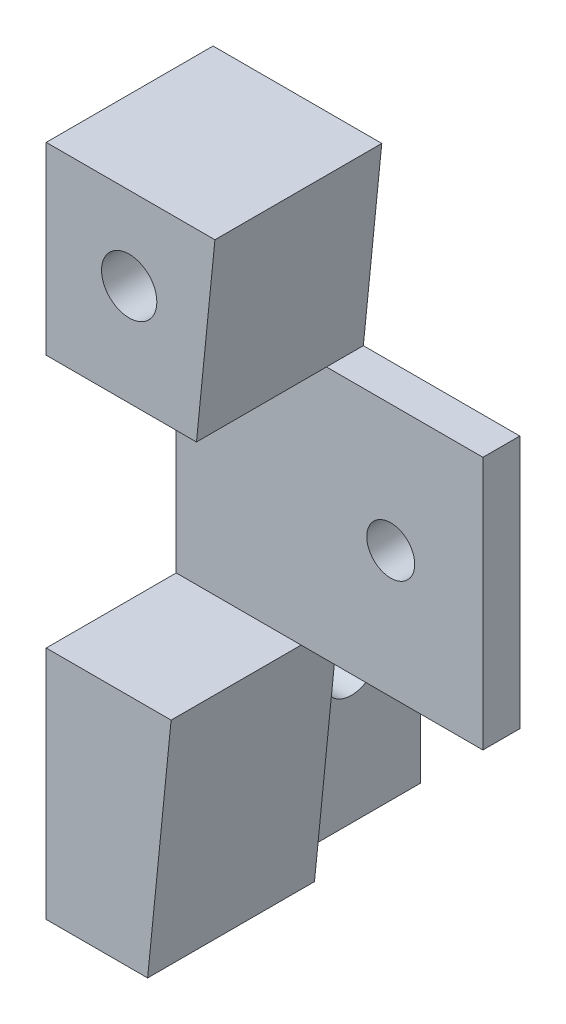
ISO-10303-21;
HEADER;
FILE_DESCRIPTION(('STEP AP214'),'2;1');
FILE_NAME('part.step','',(''),(''),'','','');
FILE_SCHEMA(('AUTOMOTIVE_DESIGN { 1 0 10303 214 1 1 1 1 }'));
ENDSEC;
DATA;
#1=APPLICATION_CONTEXT('core data for automotive mechanical design processes');
#2=APPLICATION_PROTOCOL_DEFINITION('international standard','automotive_design',2000,#1);
#3=PRODUCT_CONTEXT('',#1,'mechanical');
#4=PRODUCT('Part','Part','',(#3));
#5=PRODUCT_RELATED_PRODUCT_CATEGORY('part','',(#4));
#6=PRODUCT_DEFINITION_FORMATION('','',#4);
#7=PRODUCT_DEFINITION_CONTEXT('part definition',#1,'design');
#8=PRODUCT_DEFINITION('design','',#6,#7);
#9=PRODUCT_DEFINITION_SHAPE('','',#8);
#10=(LENGTH_UNIT() NAMED_UNIT(*) SI_UNIT(.MILLI.,.METRE.));
#11=(NAMED_UNIT(*) PLANE_ANGLE_UNIT() SI_UNIT($,.RADIAN.));
#12=(NAMED_UNIT(*) SI_UNIT($,.STERADIAN.) SOLID_ANGLE_UNIT());
#13=UNCERTAINTY_MEASURE_WITH_UNIT(LENGTH_MEASURE(1.E-05),#10,'distance_accuracy_value','');
#14=(GEOMETRIC_REPRESENTATION_CONTEXT(3) GLOBAL_UNCERTAINTY_ASSIGNED_CONTEXT((#13)) GLOBAL_UNIT_ASSIGNED_CONTEXT((#10,
#11,#12)) REPRESENTATION_CONTEXT('',''));
#15=CARTESIAN_POINT('',(0.,0.,0.));
#16=DIRECTION('',(0.,0.,1.));
#17=DIRECTION('',(1.,0.,0.));
#18=AXIS2_PLACEMENT_3D('',#15,#16,#17);
#19=CARTESIAN_POINT('',(0.,0.,22.1000000000013));
#20=DIRECTION('',(0.,0.,-1.));
#21=DIRECTION('',(1.,0.,0.));
#22=AXIS2_PLACEMENT_3D('',#19,#20,#21);
#23=PLANE('',#22);
#24=CARTESIAN_POINT('',(137.270000000002,-335.749999999999,22.1000000000013));
#25=DIRECTION('',(0.,0.,1.));
#26=DIRECTION('',(1.,0.,0.));
#27=AXIS2_PLACEMENT_3D('',#24,#25,#26);
#28=CIRCLE('',#27,2.59999999999999);
#29=CARTESIAN_POINT('',(139.870000000002,-335.749999999999,22.1000000000013));
#30=VERTEX_POINT('',#29);
#31=EDGE_CURVE('E180',#30,#30,#28,.T.);
#32=ORIENTED_EDGE('',*,*,#31,.F.);
#33=EDGE_LOOP('',(#32));
#34=FACE_BOUND('',#33,.T.);
#35=DIRECTION('',(1.,0.,0.));
#36=VECTOR('',#35,1.);
#37=CARTESIAN_POINT('',(130.3,-321.999999999999,22.1000000000013));
#38=LINE('',#37,#36);
#39=CARTESIAN_POINT('',(114.000000000002,-321.999999999999,22.1000000000013));
#40=VERTEX_POINT('',#39);
#41=CARTESIAN_POINT('',(130.3,-321.999999999999,22.1000000000013));
#42=VERTEX_POINT('',#41);
#43=EDGE_CURVE('E197',#40,#42,#38,.T.);
#44=ORIENTED_EDGE('',*,*,#43,.F.);
#45=DIRECTION('',(0.,1.,0.));
#46=VECTOR('',#45,1.);
#47=CARTESIAN_POINT('',(114.000000000002,0.,22.1000000000013));
#48=LINE('',#47,#46);
#49=CARTESIAN_POINT('',(114.000000000002,-349.499999999999,22.1000000000013));
#50=VERTEX_POINT('',#49);
#51=EDGE_CURVE('E233',#50,#40,#48,.T.);
#52=ORIENTED_EDGE('',*,*,#51,.F.);
#53=DIRECTION('',(-1.,0.,0.));
#54=VECTOR('',#53,1.);
#55=CARTESIAN_POINT('',(127.55,-349.499999999999,22.1000000000013));
#56=LINE('',#55,#54);
#57=CARTESIAN_POINT('',(127.55,-349.499999999999,22.1000000000013));
#58=VERTEX_POINT('',#57);
#59=EDGE_CURVE('E250',#58,#50,#56,.T.);
#60=ORIENTED_EDGE('',*,*,#59,.F.);
#61=DIRECTION('',(-1.,0.,0.));
#62=VECTOR('',#61,1.);
#63=CARTESIAN_POINT('',(-2.63602545588444E-11,-349.499999999989,22.1000000000013));
#64=LINE('',#63,#62);
#65=CARTESIAN_POINT('',(147.270000000011,-349.5,22.1000000000013));
#66=VERTEX_POINT('',#65);
#67=EDGE_CURVE('E217',#66,#58,#64,.T.);
#68=ORIENTED_EDGE('',*,*,#67,.F.);
#69=DIRECTION('',(0.,1.,0.));
#70=VECTOR('',#69,1.);
#71=CARTESIAN_POINT('',(147.270000000011,-322.,22.1000000000013));
#72=LINE('',#71,#70);
#73=CARTESIAN_POINT('',(147.270000000011,-322.,22.1000000000013));
#74=VERTEX_POINT('',#73);
#75=EDGE_CURVE('E187',#66,#74,#72,.T.);
#76=ORIENTED_EDGE('',*,*,#75,.T.);
#77=DIRECTION('',(1.,0.,0.));
#78=VECTOR('',#77,1.);
#79=CARTESIAN_POINT('',(-2.98656486156187E-11,-321.999999999986,22.1000000000013));
#80=LINE('',#79,#78);
#81=EDGE_CURVE('E208',#42,#74,#80,.T.);
#82=ORIENTED_EDGE('',*,*,#81,.F.);
#83=EDGE_LOOP('',(#44,#52,#60,#68,#76,#82));
#84=FACE_BOUND('',#83,.T.);
#85=ADVANCED_FACE('F49',(#34,#84),#23,.F.);
#86=CARTESIAN_POINT('',(114.000000000002,-374.999999999999,-6.77650428981949));
#87=DIRECTION('',(1.36254643931287E-13,1.,0.));
#88=DIRECTION('',(-1.,1.36254643931287E-13,0.));
#89=AXIS2_PLACEMENT_3D('',#86,#87,#88);
#90=PLANE('',#89);
#91=DIRECTION('',(0.,0.,1.));
#92=VECTOR('',#91,1.);
#93=CARTESIAN_POINT('',(125.,-375.,-6.77650428981949));
#94=LINE('',#93,#92);
#95=CARTESIAN_POINT('',(125.,-375.,18.1000000000013));
#96=VERTEX_POINT('',#95);
#97=CARTESIAN_POINT('',(125.,-375.,36.2000000000025));
#98=VERTEX_POINT('',#97);
#99=EDGE_CURVE('E259',#96,#98,#94,.T.);
#100=ORIENTED_EDGE('',*,*,#99,.T.);
#101=DIRECTION('',(1.,-1.36254643931287E-13,0.));
#102=VECTOR('',#101,1.);
#103=CARTESIAN_POINT('',(114.000000000002,-374.999999999999,36.2000000000025));
#104=LINE('',#103,#102);
#105=CARTESIAN_POINT('',(114.000000000002,-374.999999999999,36.2000000000025));
#106=VERTEX_POINT('',#105);
#107=EDGE_CURVE('E260',#106,#98,#104,.T.);
#108=ORIENTED_EDGE('',*,*,#107,.F.);
#109=DIRECTION('',(0.,0.,1.));
#110=VECTOR('',#109,1.);
#111=CARTESIAN_POINT('',(114.000000000002,-374.999999999999,-6.77650428981949));
#112=LINE('',#111,#110);
#113=CARTESIAN_POINT('',(114.000000000002,-374.999999999999,3.10000000000127));
#114=VERTEX_POINT('',#113);
#115=EDGE_CURVE('E168',#114,#106,#112,.T.);
#116=ORIENTED_EDGE('',*,*,#115,.F.);
#117=DIRECTION('',(-1.,0.,0.));
#118=VECTOR('',#117,1.);
#119=CARTESIAN_POINT('',(114.000000000002,-374.999999999999,3.10000000000127));
#120=LINE('',#119,#118);
#121=CARTESIAN_POINT('',(121.500000000002,-374.999999999999,3.10000000000127));
#122=VERTEX_POINT('',#121);
#123=EDGE_CURVE('E151',#122,#114,#120,.T.);
#124=ORIENTED_EDGE('',*,*,#123,.F.);
#125=DIRECTION('',(0.,0.,1.));
#126=VECTOR('',#125,1.);
#127=CARTESIAN_POINT('',(121.500000000002,-374.999999999999,3.10000000000127));
#128=LINE('',#127,#126);
#129=CARTESIAN_POINT('',(121.500000000002,-374.999999999999,18.1000000000013));
#130=VERTEX_POINT('',#129);
#131=EDGE_CURVE('E158',#122,#130,#128,.T.);
#132=ORIENTED_EDGE('',*,*,#131,.T.);
#133=DIRECTION('',(1.,-1.36254643931287E-13,0.));
#134=VECTOR('',#133,1.);
#135=CARTESIAN_POINT('',(-5.10954914742303E-11,-374.999999999983,18.1000000000013));
#136=LINE('',#135,#134);
#137=EDGE_CURVE('E223',#130,#96,#136,.T.);
#138=ORIENTED_EDGE('',*,*,#137,.T.);
#139=EDGE_LOOP('',(#100,#108,#116,#124,#132,#138));
#140=FACE_BOUND('',#139,.T.);
#141=ADVANCED_FACE('F165',(#140),#90,.F.);
#142=CARTESIAN_POINT('',(125.,-375.,-6.77650428981949));
#143=DIRECTION('',(-0.995037190209989,0.0995037190209987,0.));
#144=DIRECTION('',(-0.0995037190209987,-0.995037190209989,0.));
#145=AXIS2_PLACEMENT_3D('',#142,#143,#144);
#146=PLANE('',#145);
#147=DIRECTION('',(0.,0.,1.));
#148=VECTOR('',#147,1.);
#149=CARTESIAN_POINT('',(127.55,-349.499999999999,-6.77650428981949));
#150=LINE('',#149,#148);
#151=CARTESIAN_POINT('',(127.55,-349.499999999999,36.2000000000025));
#152=VERTEX_POINT('',#151);
#153=EDGE_CURVE('E255',#58,#152,#150,.T.);
#154=ORIENTED_EDGE('',*,*,#153,.T.);
#155=DIRECTION('',(0.0995037190209987,0.995037190209989,0.));
#156=VECTOR('',#155,1.);
#157=CARTESIAN_POINT('',(125.,-375.,36.2000000000025));
#158=LINE('',#157,#156);
#159=EDGE_CURVE('E256',#98,#152,#158,.T.);
#160=ORIENTED_EDGE('',*,*,#159,.F.);
#161=ORIENTED_EDGE('',*,*,#99,.F.);
#162=DIRECTION('',(0.0995037190209987,0.995037190209989,0.));
#163=VECTOR('',#162,1.);
#164=CARTESIAN_POINT('',(160.891089108911,-16.0891089108911,18.1000000000013));
#165=LINE('',#164,#163);
#166=CARTESIAN_POINT('',(127.55,-349.499999999999,18.1000000000013));
#167=VERTEX_POINT('',#166);
#168=EDGE_CURVE('E225',#96,#167,#165,.T.);
#169=ORIENTED_EDGE('',*,*,#168,.T.);
#170=DIRECTION('',(0.,0.,1.));
#171=VECTOR('',#170,1.);
#172=CARTESIAN_POINT('',(127.55,-349.499999999999,18.1000000000013));
#173=LINE('',#172,#171);
#174=EDGE_CURVE('E230',#167,#58,#173,.T.);
#175=ORIENTED_EDGE('',*,*,#174,.T.);
#176=EDGE_LOOP('',(#154,#160,#161,#169,#175));
#177=FACE_BOUND('',#176,.T.);
#178=ADVANCED_FACE('F313',(#177),#146,.F.);
#179=CARTESIAN_POINT('',(127.55,-349.499999999999,-6.77650428981949));
#180=DIRECTION('',(0.,-1.,0.));
#181=DIRECTION('',(0.,0.,1.));
#182=AXIS2_PLACEMENT_3D('',#179,#180,#181);
#183=PLANE('',#182);
#184=ORIENTED_EDGE('',*,*,#59,.T.);
#185=DIRECTION('',(0.,0.,1.));
#186=VECTOR('',#185,1.);
#187=CARTESIAN_POINT('',(114.000000000002,-349.499999999999,-6.77650428981949));
#188=LINE('',#187,#186);
#189=CARTESIAN_POINT('',(114.000000000002,-349.499999999999,36.2000000000025));
#190=VERTEX_POINT('',#189);
#191=EDGE_CURVE('E251',#50,#190,#188,.T.);
#192=ORIENTED_EDGE('',*,*,#191,.T.);
#193=DIRECTION('',(-1.,0.,0.));
#194=VECTOR('',#193,1.);
#195=CARTESIAN_POINT('',(127.55,-349.499999999999,36.2000000000025));
#196=LINE('',#195,#194);
#197=EDGE_CURVE('E252',#152,#190,#196,.T.);
#198=ORIENTED_EDGE('',*,*,#197,.F.);
#199=ORIENTED_EDGE('',*,*,#153,.F.);
#200=EDGE_LOOP('',(#184,#192,#198,#199));
#201=FACE_BOUND('',#200,.T.);
#202=ADVANCED_FACE('F361',(#201),#183,.F.);
#203=CARTESIAN_POINT('',(114.000000000002,-349.499999999999,-6.77650428981949));
#204=DIRECTION('',(1.,0.,0.));
#205=DIRECTION('',(0.,0.,1.));
#206=AXIS2_PLACEMENT_3D('',#203,#204,#205);
#207=PLANE('',#206);
#208=CARTESIAN_POINT('',(114.000000000002,-359.999999999999,10.6000000000013));
#209=DIRECTION('',(1.,0.,0.));
#210=DIRECTION('',(0.,0.,-1.));
#211=AXIS2_PLACEMENT_3D('',#208,#209,#210);
#212=CIRCLE('',#211,3.);
#213=CARTESIAN_POINT('',(114.000000000002,-359.999999999999,7.60000000000127));
#214=VERTEX_POINT('',#213);
#215=EDGE_CURVE('E172',#214,#214,#212,.T.);
#216=ORIENTED_EDGE('',*,*,#215,.T.);
#217=EDGE_LOOP('',(#216));
#218=FACE_BOUND('',#217,.T.);
#219=ORIENTED_EDGE('',*,*,#115,.T.);
#220=DIRECTION('',(0.,-1.,0.));
#221=VECTOR('',#220,1.);
#222=CARTESIAN_POINT('',(114.000000000002,-349.499999999999,36.2000000000025));
#223=LINE('',#222,#221);
#224=EDGE_CURVE('E248',#190,#106,#223,.T.);
#225=ORIENTED_EDGE('',*,*,#224,.F.);
#226=ORIENTED_EDGE('',*,*,#191,.F.);
#227=ORIENTED_EDGE('',*,*,#51,.T.);
#228=DIRECTION('',(0.,0.,1.));
#229=VECTOR('',#228,1.);
#230=CARTESIAN_POINT('',(114.000000000002,-321.999999999999,-6.77650428981949));
#231=LINE('',#230,#229);
#232=CARTESIAN_POINT('',(114.000000000002,-321.999999999999,36.2000000000025));
#233=VERTEX_POINT('',#232);
#234=EDGE_CURVE('E201',#40,#233,#231,.T.);
#235=ORIENTED_EDGE('',*,*,#234,.T.);
#236=DIRECTION('',(0.,-1.,0.));
#237=VECTOR('',#236,1.);
#238=CARTESIAN_POINT('',(114.000000000002,-321.999999999999,36.2000000000025));
#239=LINE('',#238,#237);
#240=CARTESIAN_POINT('',(114.000000000002,-301.999999999999,36.2000000000025));
#241=VERTEX_POINT('',#240);
#242=EDGE_CURVE('E202',#241,#233,#239,.T.);
#243=ORIENTED_EDGE('',*,*,#242,.F.);
#244=DIRECTION('',(0.,0.,1.));
#245=VECTOR('',#244,1.);
#246=CARTESIAN_POINT('',(114.000000000002,-301.999999999999,18.1000000000013));
#247=LINE('',#246,#245);
#248=CARTESIAN_POINT('',(114.000000000002,-301.999999999999,18.1000000000013));
#249=VERTEX_POINT('',#248);
#250=EDGE_CURVE('E239',#249,#241,#247,.T.);
#251=ORIENTED_EDGE('',*,*,#250,.F.);
#252=DIRECTION('',(0.,1.,0.));
#253=VECTOR('',#252,1.);
#254=CARTESIAN_POINT('',(114.000000000002,0.,18.1000000000013));
#255=LINE('',#254,#253);
#256=CARTESIAN_POINT('',(114.000000000002,-339.499999999998,18.1000000000013));
#257=VERTEX_POINT('',#256);
#258=EDGE_CURVE('E221',#257,#249,#255,.T.);
#259=ORIENTED_EDGE('',*,*,#258,.F.);
#260=DIRECTION('',(0.,-0.499999999999996,-0.866025403784441));
#261=VECTOR('',#260,1.);
#262=CARTESIAN_POINT('',(114.000000000002,-352.771842336167,-4.88750523628661));
#263=LINE('',#262,#261);
#264=CARTESIAN_POINT('',(114.000000000002,-348.160254037843,3.10000000000127));
#265=VERTEX_POINT('',#264);
#266=EDGE_CURVE('E11',#257,#265,#263,.T.);
#267=ORIENTED_EDGE('',*,*,#266,.T.);
#268=DIRECTION('',(0.,1.,0.));
#269=VECTOR('',#268,1.);
#270=CARTESIAN_POINT('',(114.000000000002,-374.999999999999,3.10000000000127));
#271=LINE('',#270,#269);
#272=EDGE_CURVE('E65',#114,#265,#271,.T.);
#273=ORIENTED_EDGE('',*,*,#272,.F.);
#274=EDGE_LOOP('',(#219,#225,#226,#227,#235,#243,#251,#259,#267,#273));
#275=FACE_BOUND('',#274,.T.);
#276=ADVANCED_FACE('F285',(#218,#275),#207,.F.);
#277=CARTESIAN_POINT('',(0.,0.,36.2000000000025));
#278=DIRECTION('',(0.,0.,1.));
#279=DIRECTION('',(-1.,0.,0.));
#280=AXIS2_PLACEMENT_3D('',#277,#278,#279);
#281=PLANE('',#280);
#282=ORIENTED_EDGE('',*,*,#107,.T.);
#283=ORIENTED_EDGE('',*,*,#159,.T.);
#284=ORIENTED_EDGE('',*,*,#197,.T.);
#285=ORIENTED_EDGE('',*,*,#224,.T.);
#286=EDGE_LOOP('',(#282,#283,#284,#285));
#287=FACE_BOUND('',#286,.T.);
#288=ADVANCED_FACE('F315',(#287),#281,.T.);
#289=CARTESIAN_POINT('',(-2.98656486156187E-11,-321.999999999986,18.1000000000013));
#290=DIRECTION('',(0.,1.,0.));
#291=DIRECTION('',(-1.,0.,0.));
#292=AXIS2_PLACEMENT_3D('',#289,#290,#291);
#293=PLANE('',#292);
#294=ORIENTED_EDGE('',*,*,#81,.T.);
#295=DIRECTION('',(0.,0.,-1.));
#296=VECTOR('',#295,1.);
#297=CARTESIAN_POINT('',(147.270000000011,-322.,18.1000000000013));
#298=LINE('',#297,#296);
#299=CARTESIAN_POINT('',(147.270000000011,-322.,18.1000000000013));
#300=VERTEX_POINT('',#299);
#301=EDGE_CURVE('E190',#74,#300,#298,.T.);
#302=ORIENTED_EDGE('',*,*,#301,.T.);
#303=DIRECTION('',(1.,0.,0.));
#304=VECTOR('',#303,1.);
#305=CARTESIAN_POINT('',(-2.98656486156187E-11,-321.999999999986,18.1000000000013));
#306=LINE('',#305,#304);
#307=CARTESIAN_POINT('',(130.3,-321.999999999999,18.1000000000013));
#308=VERTEX_POINT('',#307);
#309=EDGE_CURVE('E213',#308,#300,#306,.T.);
#310=ORIENTED_EDGE('',*,*,#309,.F.);
#311=DIRECTION('',(0.,0.,1.));
#312=VECTOR('',#311,1.);
#313=CARTESIAN_POINT('',(130.3,-321.999999999999,18.1000000000013));
#314=LINE('',#313,#312);
#315=EDGE_CURVE('E245',#308,#42,#314,.T.);
#316=ORIENTED_EDGE('',*,*,#315,.T.);
#317=EDGE_LOOP('',(#294,#302,#310,#316));
#318=FACE_BOUND('',#317,.T.);
#319=ADVANCED_FACE('F298',(#318),#293,.T.);
#320=CARTESIAN_POINT('',(160.891089108911,-16.0891089108911,18.1000000000013));
#321=DIRECTION('',(0.995037190209989,-0.0995037190209989,0.));
#322=DIRECTION('',(0.0995037190209989,0.995037190209989,0.));
#323=AXIS2_PLACEMENT_3D('',#320,#321,#322);
#324=PLANE('',#323);
#325=ORIENTED_EDGE('',*,*,#315,.F.);
#326=DIRECTION('',(-0.0995037190209988,-0.995037190209989,0.));
#327=VECTOR('',#326,1.);
#328=CARTESIAN_POINT('',(160.891089108911,-16.0891089108911,18.1000000000013));
#329=LINE('',#328,#327);
#330=CARTESIAN_POINT('',(132.3,-301.999999999999,18.1000000000013));
#331=VERTEX_POINT('',#330);
#332=EDGE_CURVE('E216',#331,#308,#329,.T.);
#333=ORIENTED_EDGE('',*,*,#332,.F.);
#334=DIRECTION('',(0.,0.,1.));
#335=VECTOR('',#334,1.);
#336=CARTESIAN_POINT('',(132.3,-301.999999999999,18.1000000000013));
#337=LINE('',#336,#335);
#338=CARTESIAN_POINT('',(132.3,-301.999999999999,36.2000000000025));
#339=VERTEX_POINT('',#338);
#340=EDGE_CURVE('E242',#331,#339,#337,.T.);
#341=ORIENTED_EDGE('',*,*,#340,.T.);
#342=DIRECTION('',(0.0995037190209989,0.995037190209989,0.));
#343=VECTOR('',#342,1.);
#344=CARTESIAN_POINT('',(132.3,-301.999999999999,36.2000000000025));
#345=LINE('',#344,#343);
#346=CARTESIAN_POINT('',(130.3,-321.999999999999,36.2000000000025));
#347=VERTEX_POINT('',#346);
#348=EDGE_CURVE('E194',#347,#339,#345,.T.);
#349=ORIENTED_EDGE('',*,*,#348,.F.);
#350=DIRECTION('',(0.,0.,1.));
#351=VECTOR('',#350,1.);
#352=CARTESIAN_POINT('',(130.3,-321.999999999999,-6.77650428981949));
#353=LINE('',#352,#351);
#354=EDGE_CURVE('E198',#42,#347,#353,.T.);
#355=ORIENTED_EDGE('',*,*,#354,.F.);
#356=EDGE_LOOP('',(#325,#333,#341,#349,#355));
#357=FACE_BOUND('',#356,.T.);
#358=ADVANCED_FACE('F294',(#357),#324,.T.);
#359=CARTESIAN_POINT('',(0.,-301.999999999999,18.1000000000013));
#360=DIRECTION('',(0.,1.,0.));
#361=DIRECTION('',(0.,0.,-1.));
#362=AXIS2_PLACEMENT_3D('',#359,#360,#361);
#363=PLANE('',#362);
#364=ORIENTED_EDGE('',*,*,#340,.F.);
#365=DIRECTION('',(1.,0.,0.));
#366=VECTOR('',#365,1.);
#367=CARTESIAN_POINT('',(0.,-301.999999999999,18.1000000000013));
#368=LINE('',#367,#366);
#369=EDGE_CURVE('E219',#249,#331,#368,.T.);
#370=ORIENTED_EDGE('',*,*,#369,.F.);
#371=ORIENTED_EDGE('',*,*,#250,.T.);
#372=DIRECTION('',(-1.,0.,0.));
#373=VECTOR('',#372,1.);
#374=CARTESIAN_POINT('',(114.000000000002,-301.999999999999,36.2000000000025));
#375=LINE('',#374,#373);
#376=EDGE_CURVE('E193',#339,#241,#375,.T.);
#377=ORIENTED_EDGE('',*,*,#376,.F.);
#378=EDGE_LOOP('',(#364,#370,#371,#377));
#379=FACE_BOUND('',#378,.T.);
#380=ADVANCED_FACE('F289',(#379),#363,.T.);
#381=CARTESIAN_POINT('',(-2.63602545588444E-11,-349.499999999989,18.1000000000013));
#382=DIRECTION('',(0.,-1.,0.));
#383=DIRECTION('',(1.,0.,0.));
#384=AXIS2_PLACEMENT_3D('',#381,#382,#383);
#385=PLANE('',#384);
#386=ORIENTED_EDGE('',*,*,#67,.T.);
#387=ORIENTED_EDGE('',*,*,#174,.F.);
#388=DIRECTION('',(-1.,0.,0.));
#389=VECTOR('',#388,1.);
#390=CARTESIAN_POINT('',(-2.63602545588444E-11,-349.499999999989,18.1000000000013));
#391=LINE('',#390,#389);
#392=CARTESIAN_POINT('',(147.270000000011,-349.5,18.1000000000013));
#393=VERTEX_POINT('',#392);
#394=EDGE_CURVE('E228',#393,#167,#391,.T.);
#395=ORIENTED_EDGE('',*,*,#394,.F.);
#396=DIRECTION('',(0.,0.,1.));
#397=VECTOR('',#396,1.);
#398=CARTESIAN_POINT('',(147.270000000011,-349.5,18.1000000000013));
#399=LINE('',#398,#397);
#400=EDGE_CURVE('E185',#393,#66,#399,.T.);
#401=ORIENTED_EDGE('',*,*,#400,.T.);
#402=EDGE_LOOP('',(#386,#387,#395,#401));
#403=FACE_BOUND('',#402,.T.);
#404=ADVANCED_FACE('F309',(#403),#385,.T.);
#405=CARTESIAN_POINT('',(0.,0.,18.1000000000013));
#406=DIRECTION('',(0.,0.,-1.));
#407=DIRECTION('',(1.,0.,0.));
#408=AXIS2_PLACEMENT_3D('',#405,#406,#407);
#409=PLANE('',#408);
#410=DIRECTION('',(0.,-1.,0.));
#411=VECTOR('',#410,1.);
#412=CARTESIAN_POINT('',(121.500000000002,-374.999999999999,18.1000000000013));
#413=LINE('',#412,#411);
#414=CARTESIAN_POINT('',(121.500000000002,-339.499999999998,18.1000000000013));
#415=VERTEX_POINT('',#414);
#416=EDGE_CURVE('E160',#415,#130,#413,.T.);
#417=ORIENTED_EDGE('',*,*,#416,.F.);
#418=DIRECTION('',(-1.,0.,0.));
#419=VECTOR('',#418,1.);
#420=CARTESIAN_POINT('',(0.,-339.499999999998,18.1000000000013));
#421=LINE('',#420,#419);
#422=EDGE_CURVE('E265',#415,#257,#421,.T.);
#423=ORIENTED_EDGE('',*,*,#422,.T.);
#424=ORIENTED_EDGE('',*,*,#258,.T.);
#425=ORIENTED_EDGE('',*,*,#369,.T.);
#426=ORIENTED_EDGE('',*,*,#332,.T.);
#427=ORIENTED_EDGE('',*,*,#309,.T.);
#428=DIRECTION('',(0.,-1.,0.));
#429=VECTOR('',#428,1.);
#430=CARTESIAN_POINT('',(147.270000000011,-322.,18.1000000000013));
#431=LINE('',#430,#429);
#432=EDGE_CURVE('E183',#300,#393,#431,.T.);
#433=ORIENTED_EDGE('',*,*,#432,.T.);
#434=ORIENTED_EDGE('',*,*,#394,.T.);
#435=ORIENTED_EDGE('',*,*,#168,.F.);
#436=ORIENTED_EDGE('',*,*,#137,.F.);
#437=EDGE_LOOP('',(#417,#423,#424,#425,#426,#427,#433,#434,#435,#436));
#438=FACE_BOUND('',#437,.T.);
#439=CARTESIAN_POINT('',(137.270000000002,-335.749999999999,18.1000000000013));
#440=DIRECTION('',(0.,0.,1.));
#441=DIRECTION('',(1.,0.,0.));
#442=AXIS2_PLACEMENT_3D('',#439,#440,#441);
#443=CIRCLE('',#442,2.59999999999999);
#444=CARTESIAN_POINT('',(139.870000000002,-335.749999999999,18.1000000000013));
#445=VERTEX_POINT('',#444);
#446=EDGE_CURVE('E174',#445,#445,#443,.T.);
#447=ORIENTED_EDGE('',*,*,#446,.T.);
#448=EDGE_LOOP('',(#447));
#449=FACE_BOUND('',#448,.T.);
#450=CARTESIAN_POINT('',(123.000000000002,-310.999999999999,18.1000000000013));
#451=DIRECTION('',(0.,0.,1.));
#452=DIRECTION('',(1.,0.,0.));
#453=AXIS2_PLACEMENT_3D('',#450,#451,#452);
#454=CIRCLE('',#453,2.99999999999996);
#455=CARTESIAN_POINT('',(126.000000000002,-310.999999999999,18.1000000000013));
#456=VERTEX_POINT('',#455);
#457=EDGE_CURVE('E162',#456,#456,#454,.T.);
#458=ORIENTED_EDGE('',*,*,#457,.T.);
#459=EDGE_LOOP('',(#458));
#460=FACE_BOUND('',#459,.T.);
#461=ADVANCED_FACE('F280',(#438,#449,#460),#409,.T.);
#462=CARTESIAN_POINT('',(130.3,-321.999999999999,-6.77650428981949));
#463=DIRECTION('',(0.,1.,0.));
#464=DIRECTION('',(0.,0.,-1.));
#465=AXIS2_PLACEMENT_3D('',#462,#463,#464);
#466=PLANE('',#465);
#467=ORIENTED_EDGE('',*,*,#43,.T.);
#468=ORIENTED_EDGE('',*,*,#354,.T.);
#469=DIRECTION('',(1.,0.,0.));
#470=VECTOR('',#469,1.);
#471=CARTESIAN_POINT('',(130.3,-321.999999999999,36.2000000000025));
#472=LINE('',#471,#470);
#473=EDGE_CURVE('E199',#233,#347,#472,.T.);
#474=ORIENTED_EDGE('',*,*,#473,.F.);
#475=ORIENTED_EDGE('',*,*,#234,.F.);
#476=EDGE_LOOP('',(#467,#468,#474,#475));
#477=FACE_BOUND('',#476,.T.);
#478=ADVANCED_FACE('F403',(#477),#466,.F.);
#479=CARTESIAN_POINT('',(0.,0.,36.2000000000025));
#480=DIRECTION('',(0.,0.,-1.));
#481=DIRECTION('',(1.,0.,0.));
#482=AXIS2_PLACEMENT_3D('',#479,#480,#481);
#483=PLANE('',#482);
#484=CARTESIAN_POINT('',(123.000000000002,-310.999999999999,36.2000000000025));
#485=DIRECTION('',(0.,0.,1.));
#486=DIRECTION('',(1.,0.,0.));
#487=AXIS2_PLACEMENT_3D('',#484,#485,#486);
#488=CIRCLE('',#487,2.99999999999996);
#489=CARTESIAN_POINT('',(126.000000000002,-310.999999999999,36.2000000000025));
#490=VERTEX_POINT('',#489);
#491=EDGE_CURVE('E177',#490,#490,#488,.T.);
#492=ORIENTED_EDGE('',*,*,#491,.F.);
#493=EDGE_LOOP('',(#492));
#494=FACE_BOUND('',#493,.T.);
#495=ORIENTED_EDGE('',*,*,#376,.T.);
#496=ORIENTED_EDGE('',*,*,#242,.T.);
#497=ORIENTED_EDGE('',*,*,#473,.T.);
#498=ORIENTED_EDGE('',*,*,#348,.T.);
#499=EDGE_LOOP('',(#495,#496,#497,#498));
#500=FACE_BOUND('',#499,.T.);
#501=ADVANCED_FACE('F406',(#494,#500),#483,.F.);
#502=CARTESIAN_POINT('',(147.270000000009,1.0384521525515E-12,36.2000000000025));
#503=DIRECTION('',(1.,0.,0.));
#504=DIRECTION('',(0.,1.,0.));
#505=AXIS2_PLACEMENT_3D('',#502,#503,#504);
#506=PLANE('',#505);
#507=ORIENTED_EDGE('',*,*,#432,.F.);
#508=ORIENTED_EDGE('',*,*,#301,.F.);
#509=ORIENTED_EDGE('',*,*,#75,.F.);
#510=ORIENTED_EDGE('',*,*,#400,.F.);
#511=EDGE_LOOP('',(#507,#508,#509,#510));
#512=FACE_BOUND('',#511,.T.);
#513=ADVANCED_FACE('F301',(#512),#506,.T.);
#514=CARTESIAN_POINT('',(123.000000000002,-310.999999999999,53.1000000000013));
#515=DIRECTION('',(0.,0.,-1.));
#516=DIRECTION('',(1.,0.,0.));
#517=AXIS2_PLACEMENT_3D('',#514,#515,#516);
#518=CYLINDRICAL_SURFACE('',#517,2.99999999999996);
#519=ORIENTED_EDGE('',*,*,#457,.F.);
#520=EDGE_LOOP('',(#519));
#521=FACE_BOUND('',#520,.T.);
#522=ORIENTED_EDGE('',*,*,#491,.T.);
#523=EDGE_LOOP('',(#522));
#524=FACE_BOUND('',#523,.T.);
#525=ADVANCED_FACE('F335',(#521,#524),#518,.F.);
#526=CARTESIAN_POINT('',(137.270000000002,-335.749999999999,53.1000000000013));
#527=DIRECTION('',(0.,0.,-1.));
#528=DIRECTION('',(1.,0.,0.));
#529=AXIS2_PLACEMENT_3D('',#526,#527,#528);
#530=CYLINDRICAL_SURFACE('',#529,2.59999999999999);
#531=ORIENTED_EDGE('',*,*,#446,.F.);
#532=EDGE_LOOP('',(#531));
#533=FACE_BOUND('',#532,.T.);
#534=ORIENTED_EDGE('',*,*,#31,.T.);
#535=EDGE_LOOP('',(#534));
#536=FACE_BOUND('',#535,.T.);
#537=ADVANCED_FACE('F326',(#533,#536),#530,.F.);
#538=CARTESIAN_POINT('',(121.500000000002,-374.999999999999,3.10000000000127));
#539=DIRECTION('',(-1.,0.,0.));
#540=DIRECTION('',(0.,0.,1.));
#541=AXIS2_PLACEMENT_3D('',#538,#539,#540);
#542=PLANE('',#541);
#543=CARTESIAN_POINT('',(121.500000000002,-359.999999999999,10.6000000000013));
#544=DIRECTION('',(1.,0.,0.));
#545=DIRECTION('',(0.,0.,-1.));
#546=AXIS2_PLACEMENT_3D('',#543,#544,#545);
#547=CIRCLE('',#546,3.);
#548=CARTESIAN_POINT('',(121.500000000002,-359.999999999999,7.60000000000127));
#549=VERTEX_POINT('',#548);
#550=EDGE_CURVE('E319',#549,#549,#547,.T.);
#551=ORIENTED_EDGE('',*,*,#550,.F.);
#552=EDGE_LOOP('',(#551));
#553=FACE_BOUND('',#552,.T.);
#554=ORIENTED_EDGE('',*,*,#416,.T.);
#555=ORIENTED_EDGE('',*,*,#131,.F.);
#556=DIRECTION('',(0.,-1.,0.));
#557=VECTOR('',#556,1.);
#558=CARTESIAN_POINT('',(121.500000000002,-374.999999999999,3.10000000000127));
#559=LINE('',#558,#557);
#560=CARTESIAN_POINT('',(121.500000000002,-348.160254037843,3.10000000000127));
#561=VERTEX_POINT('',#560);
#562=EDGE_CURVE('E72',#561,#122,#559,.T.);
#563=ORIENTED_EDGE('',*,*,#562,.F.);
#564=DIRECTION('',(0.,0.499999999999996,0.866025403784441));
#565=VECTOR('',#564,1.);
#566=CARTESIAN_POINT('',(121.500000000002,-354.870190528382,-8.52195091717251));
#567=LINE('',#566,#565);
#568=EDGE_CURVE('E58',#561,#415,#567,.T.);
#569=ORIENTED_EDGE('',*,*,#568,.T.);
#570=EDGE_LOOP('',(#554,#555,#563,#569));
#571=FACE_BOUND('',#570,.T.);
#572=ADVANCED_FACE('F159',(#553,#571),#542,.F.);
#573=CARTESIAN_POINT('',(0.,0.,3.10000000000127));
#574=DIRECTION('',(0.,0.,-1.));
#575=DIRECTION('',(-1.,0.,0.));
#576=AXIS2_PLACEMENT_3D('',#573,#574,#575);
#577=PLANE('',#576);
#578=ORIENTED_EDGE('',*,*,#272,.T.);
#579=DIRECTION('',(1.,0.,0.));
#580=VECTOR('',#579,1.);
#581=CARTESIAN_POINT('',(114.000000000002,-348.160254037843,3.10000000000127));
#582=LINE('',#581,#580);
#583=EDGE_CURVE('E153',#265,#561,#582,.T.);
#584=ORIENTED_EDGE('',*,*,#583,.T.);
#585=ORIENTED_EDGE('',*,*,#562,.T.);
#586=ORIENTED_EDGE('',*,*,#123,.T.);
#587=EDGE_LOOP('',(#578,#584,#585,#586));
#588=FACE_BOUND('',#587,.T.);
#589=ADVANCED_FACE('F149',(#588),#577,.T.);
#590=CARTESIAN_POINT('',(114.000000000002,-349.499999999999,0.779491924312127));
#591=DIRECTION('',(0.,-0.866025403784441,0.499999999999996));
#592=DIRECTION('',(1.,0.,0.));
#593=AXIS2_PLACEMENT_3D('',#590,#591,#592);
#594=PLANE('',#593);
#595=ORIENTED_EDGE('',*,*,#266,.F.);
#596=ORIENTED_EDGE('',*,*,#422,.F.);
#597=ORIENTED_EDGE('',*,*,#568,.F.);
#598=ORIENTED_EDGE('',*,*,#583,.F.);
#599=EDGE_LOOP('',(#595,#596,#597,#598));
#600=FACE_BOUND('',#599,.T.);
#601=ADVANCED_FACE('F52',(#600),#594,.F.);
#602=CARTESIAN_POINT('',(121.500000000002,-359.999999999999,10.6000000000013));
#603=DIRECTION('',(1.,0.,0.));
#604=DIRECTION('',(0.,0.,-1.));
#605=AXIS2_PLACEMENT_3D('',#602,#603,#604);
#606=CYLINDRICAL_SURFACE('',#605,3.);
#607=ORIENTED_EDGE('',*,*,#215,.F.);
#608=EDGE_LOOP('',(#607));
#609=FACE_BOUND('',#608,.T.);
#610=ORIENTED_EDGE('',*,*,#550,.T.);
#611=EDGE_LOOP('',(#610));
#612=FACE_BOUND('',#611,.T.);
#613=ADVANCED_FACE('F323',(#609,#612),#606,.F.);
#614=CLOSED_SHELL('',(#85,#141,#178,#202,#276,#288,#319,#358,#380,#404,#461,#478,#501,#513,#525,
#537,#572,#589,#601,#613));
#615=MANIFOLD_SOLID_BREP('B2',#614);
#616=ADVANCED_BREP_SHAPE_REPRESENTATION('',(#18,#615),#14);
#617=SHAPE_DEFINITION_REPRESENTATION(#9,#616);
ENDSEC;
END-ISO-10303-21;
